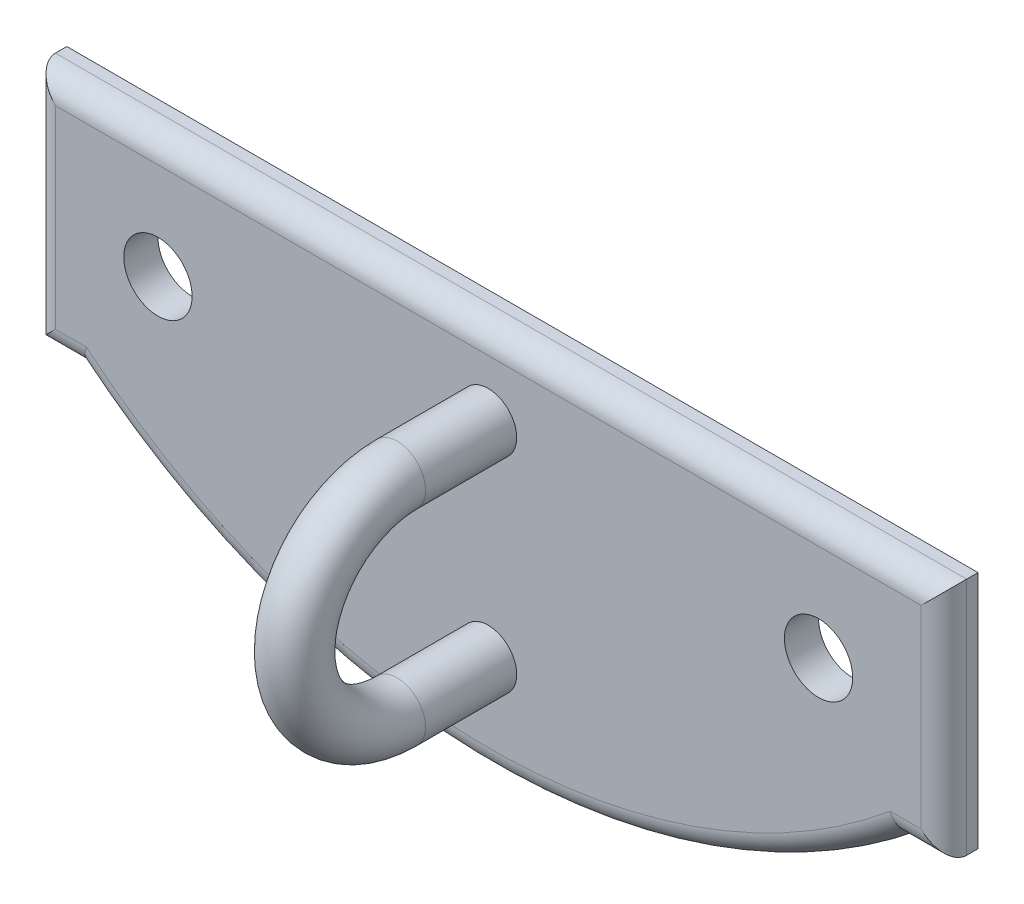
ISO-10303-21;
HEADER;
FILE_DESCRIPTION(('STEP AP214'),'2;1');
FILE_NAME('part.step','',(''),(''),'','','');
FILE_SCHEMA(('AUTOMOTIVE_DESIGN { 1 0 10303 214 1 1 1 1 }'));
ENDSEC;
DATA;
#1=APPLICATION_CONTEXT('core data for automotive mechanical design processes');
#2=APPLICATION_PROTOCOL_DEFINITION('international standard','automotive_design',2000,#1);
#3=PRODUCT_CONTEXT('',#1,'mechanical');
#4=PRODUCT('Part','Part','',(#3));
#5=PRODUCT_RELATED_PRODUCT_CATEGORY('part','',(#4));
#6=PRODUCT_DEFINITION_FORMATION('','',#4);
#7=PRODUCT_DEFINITION_CONTEXT('part definition',#1,'design');
#8=PRODUCT_DEFINITION('design','',#6,#7);
#9=PRODUCT_DEFINITION_SHAPE('','',#8);
#10=(LENGTH_UNIT() NAMED_UNIT(*) SI_UNIT(.MILLI.,.METRE.));
#11=(NAMED_UNIT(*) PLANE_ANGLE_UNIT() SI_UNIT($,.RADIAN.));
#12=(NAMED_UNIT(*) SI_UNIT($,.STERADIAN.) SOLID_ANGLE_UNIT());
#13=UNCERTAINTY_MEASURE_WITH_UNIT(LENGTH_MEASURE(1.E-05),#10,'distance_accuracy_value','');
#14=(GEOMETRIC_REPRESENTATION_CONTEXT(3) GLOBAL_UNCERTAINTY_ASSIGNED_CONTEXT((#13)) GLOBAL_UNIT_ASSIGNED_CONTEXT((#10,
#11,#12)) REPRESENTATION_CONTEXT('',''));
#15=CARTESIAN_POINT('',(0.,0.,0.));
#16=DIRECTION('',(0.,0.,1.));
#17=DIRECTION('',(1.,0.,0.));
#18=AXIS2_PLACEMENT_3D('',#15,#16,#17);
#19=CARTESIAN_POINT('',(0.,11.5705776997341,1.5));
#20=DIRECTION('',(0.,0.,-1.));
#21=DIRECTION('',(-1.,0.,0.));
#22=AXIS2_PLACEMENT_3D('',#19,#20,#21);
#23=PLANE('',#22);
#24=DIRECTION('',(0.,1.,0.));
#25=VECTOR('',#24,1.);
#26=CARTESIAN_POINT('',(19.,11.5705776997341,1.5));
#27=LINE('',#26,#25);
#28=CARTESIAN_POINT('',(19.,-9.5,1.5));
#29=VERTEX_POINT('',#28);
#30=CARTESIAN_POINT('',(19.,-1.,1.5));
#31=VERTEX_POINT('',#30);
#32=EDGE_CURVE('E178',#29,#31,#27,.T.);
#33=ORIENTED_EDGE('',*,*,#32,.T.);
#34=DIRECTION('',(-1.,0.,0.));
#35=VECTOR('',#34,1.);
#36=CARTESIAN_POINT('',(0.,-1.,1.5));
#37=LINE('',#36,#35);
#38=CARTESIAN_POINT('',(-19.,-1.,1.5));
#39=VERTEX_POINT('',#38);
#40=EDGE_CURVE('E180',#31,#39,#37,.T.);
#41=ORIENTED_EDGE('',*,*,#40,.T.);
#42=DIRECTION('',(0.,-1.,0.));
#43=VECTOR('',#42,1.);
#44=CARTESIAN_POINT('',(-19.,11.5705776997341,1.5));
#45=LINE('',#44,#43);
#46=CARTESIAN_POINT('',(-19.,-9.5,1.5));
#47=VERTEX_POINT('',#46);
#48=EDGE_CURVE('E170',#39,#47,#45,.T.);
#49=ORIENTED_EDGE('',*,*,#48,.T.);
#50=DIRECTION('',(1.,0.,0.));
#51=VECTOR('',#50,1.);
#52=CARTESIAN_POINT('',(0.,-9.5,1.5));
#53=LINE('',#52,#51);
#54=CARTESIAN_POINT('',(-17.6403275309578,-9.5,1.5));
#55=VERTEX_POINT('',#54);
#56=EDGE_CURVE('E172',#47,#55,#53,.T.);
#57=ORIENTED_EDGE('',*,*,#56,.T.);
#58=CARTESIAN_POINT('',(0.,11.5705776997341,1.5));
#59=DIRECTION('',(0.,0.,-1.));
#60=DIRECTION('',(-1.,0.,0.));
#61=AXIS2_PLACEMENT_3D('',#58,#59,#60);
#62=CIRCLE('',#61,27.48);
#63=CARTESIAN_POINT('',(17.6403275309578,-9.5,1.5));
#64=VERTEX_POINT('',#63);
#65=EDGE_CURVE('E174',#55,#64,#62,.F.);
#66=ORIENTED_EDGE('',*,*,#65,.T.);
#67=DIRECTION('',(1.,0.,0.));
#68=VECTOR('',#67,1.);
#69=CARTESIAN_POINT('',(0.,-9.49999999999998,1.5));
#70=LINE('',#69,#68);
#71=EDGE_CURVE('E176',#64,#29,#70,.T.);
#72=ORIENTED_EDGE('',*,*,#71,.T.);
#73=EDGE_LOOP('',(#33,#41,#49,#57,#66,#72));
#74=FACE_BOUND('',#73,.T.);
#75=CARTESIAN_POINT('',(14.5,-5.25,1.5));
#76=DIRECTION('',(0.,0.,1.));
#77=DIRECTION('',(-1.,0.,0.));
#78=AXIS2_PLACEMENT_3D('',#75,#76,#77);
#79=CIRCLE('',#78,1.5);
#80=CARTESIAN_POINT('',(13.,-5.25,1.5));
#81=VERTEX_POINT('',#80);
#82=EDGE_CURVE('E292',#81,#81,#79,.T.);
#83=ORIENTED_EDGE('',*,*,#82,.F.);
#84=EDGE_LOOP('',(#83));
#85=FACE_BOUND('',#84,.T.);
#86=CARTESIAN_POINT('',(-14.5,-5.25,1.5));
#87=DIRECTION('',(0.,0.,1.));
#88=DIRECTION('',(1.,0.,0.));
#89=AXIS2_PLACEMENT_3D('',#86,#87,#88);
#90=CIRCLE('',#89,1.5);
#91=CARTESIAN_POINT('',(-13.,-5.25,1.5));
#92=VERTEX_POINT('',#91);
#93=EDGE_CURVE('E150',#92,#92,#90,.T.);
#94=ORIENTED_EDGE('',*,*,#93,.F.);
#95=EDGE_LOOP('',(#94));
#96=FACE_BOUND('',#95,.T.);
#97=CARTESIAN_POINT('',(0.,-12.5,1.5));
#98=DIRECTION('',(0.,0.,1.));
#99=DIRECTION('',(1.,0.,0.));
#100=AXIS2_PLACEMENT_3D('',#97,#98,#99);
#101=CIRCLE('',#100,1.25);
#102=CARTESIAN_POINT('',(1.25,-12.5,1.5));
#103=VERTEX_POINT('',#102);
#104=EDGE_CURVE('E128',#103,#103,#101,.T.);
#105=ORIENTED_EDGE('',*,*,#104,.F.);
#106=EDGE_LOOP('',(#105));
#107=FACE_BOUND('',#106,.T.);
#108=CARTESIAN_POINT('',(0.,-3.5,1.5));
#109=DIRECTION('',(0.,0.,-1.));
#110=DIRECTION('',(1.,0.,0.));
#111=AXIS2_PLACEMENT_3D('',#108,#109,#110);
#112=CIRCLE('',#111,1.25);
#113=CARTESIAN_POINT('',(1.25,-3.5,1.5));
#114=VERTEX_POINT('',#113);
#115=EDGE_CURVE('E285',#114,#114,#112,.T.);
#116=ORIENTED_EDGE('',*,*,#115,.T.);
#117=EDGE_LOOP('',(#116));
#118=FACE_BOUND('',#117,.T.);
#119=ADVANCED_FACE('F40',(#74,#85,#96,#107,#118),#23,.F.);
#120=CARTESIAN_POINT('',(-20.,0.,1.5));
#121=DIRECTION('',(1.,0.,0.));
#122=DIRECTION('',(0.,1.,0.));
#123=AXIS2_PLACEMENT_3D('',#120,#121,#122);
#124=PLANE('',#123);
#125=DIRECTION('',(0.,0.,-1.));
#126=VECTOR('',#125,1.);
#127=CARTESIAN_POINT('',(-20.,-10.5,1.5));
#128=LINE('',#127,#126);
#129=CARTESIAN_POINT('',(-20.,-10.5,0.5));
#130=VERTEX_POINT('',#129);
#131=CARTESIAN_POINT('',(-20.,-10.5,0.));
#132=VERTEX_POINT('',#131);
#133=EDGE_CURVE('E129',#130,#132,#128,.T.);
#134=ORIENTED_EDGE('',*,*,#133,.F.);
#135=DIRECTION('',(0.,-1.,0.));
#136=VECTOR('',#135,1.);
#137=CARTESIAN_POINT('',(-20.,0.,0.5));
#138=LINE('',#137,#136);
#139=CARTESIAN_POINT('',(-20.,0.,0.5));
#140=VERTEX_POINT('',#139);
#141=EDGE_CURVE('E11',#130,#140,#138,.F.);
#142=ORIENTED_EDGE('',*,*,#141,.T.);
#143=DIRECTION('',(0.,0.,-1.));
#144=VECTOR('',#143,1.);
#145=CARTESIAN_POINT('',(-20.,0.,1.5));
#146=LINE('',#145,#144);
#147=CARTESIAN_POINT('',(-20.,0.,0.));
#148=VERTEX_POINT('',#147);
#149=EDGE_CURVE('E118',#140,#148,#146,.T.);
#150=ORIENTED_EDGE('',*,*,#149,.T.);
#151=DIRECTION('',(0.,-1.,0.));
#152=VECTOR('',#151,1.);
#153=CARTESIAN_POINT('',(-20.,0.,0.));
#154=LINE('',#153,#152);
#155=EDGE_CURVE('E122',#148,#132,#154,.T.);
#156=ORIENTED_EDGE('',*,*,#155,.T.);
#157=EDGE_LOOP('',(#134,#142,#150,#156));
#158=FACE_BOUND('',#157,.T.);
#159=ADVANCED_FACE('F120',(#158),#124,.F.);
#160=CARTESIAN_POINT('',(-20.,-10.5,1.5));
#161=DIRECTION('',(0.,1.,0.));
#162=DIRECTION('',(0.,0.,1.));
#163=AXIS2_PLACEMENT_3D('',#160,#161,#162);
#164=PLANE('',#163);
#165=DIRECTION('',(0.,0.,-1.));
#166=VECTOR('',#165,1.);
#167=CARTESIAN_POINT('',(-18.,-10.5,1.5));
#168=LINE('',#167,#166);
#169=CARTESIAN_POINT('',(-18.,-10.5,0.5));
#170=VERTEX_POINT('',#169);
#171=CARTESIAN_POINT('',(-18.,-10.5,0.));
#172=VERTEX_POINT('',#171);
#173=EDGE_CURVE('E167',#170,#172,#168,.T.);
#174=ORIENTED_EDGE('',*,*,#173,.F.);
#175=DIRECTION('',(1.,0.,0.));
#176=VECTOR('',#175,1.);
#177=CARTESIAN_POINT('',(-20.,-10.5,0.5));
#178=LINE('',#177,#176);
#179=EDGE_CURVE('E55',#170,#130,#178,.F.);
#180=ORIENTED_EDGE('',*,*,#179,.T.);
#181=ORIENTED_EDGE('',*,*,#133,.T.);
#182=DIRECTION('',(1.,0.,0.));
#183=VECTOR('',#182,1.);
#184=CARTESIAN_POINT('',(-20.,-10.5,0.));
#185=LINE('',#184,#183);
#186=EDGE_CURVE('E144',#132,#172,#185,.T.);
#187=ORIENTED_EDGE('',*,*,#186,.T.);
#188=EDGE_LOOP('',(#174,#180,#181,#187));
#189=FACE_BOUND('',#188,.T.);
#190=ADVANCED_FACE('F227',(#189),#164,.F.);
#191=CARTESIAN_POINT('',(0.,11.5705776997341,1.5));
#192=DIRECTION('',(0.,0.,-1.));
#193=DIRECTION('',(-1.,0.,0.));
#194=AXIS2_PLACEMENT_3D('',#191,#192,#193);
#195=CYLINDRICAL_SURFACE('',#194,28.48);
#196=DIRECTION('',(0.,0.,-1.));
#197=VECTOR('',#196,1.);
#198=CARTESIAN_POINT('',(18.,-10.5,1.5));
#199=LINE('',#198,#197);
#200=CARTESIAN_POINT('',(18.,-10.5,0.5));
#201=VERTEX_POINT('',#200);
#202=CARTESIAN_POINT('',(18.,-10.5,0.));
#203=VERTEX_POINT('',#202);
#204=EDGE_CURVE('E165',#201,#203,#199,.T.);
#205=ORIENTED_EDGE('',*,*,#204,.F.);
#206=CARTESIAN_POINT('',(0.,11.5705776997341,0.5));
#207=DIRECTION('',(0.,0.,-1.));
#208=DIRECTION('',(-1.,0.,0.));
#209=AXIS2_PLACEMENT_3D('',#206,#207,#208);
#210=CIRCLE('',#209,28.48);
#211=EDGE_CURVE('E70',#201,#170,#210,.T.);
#212=ORIENTED_EDGE('',*,*,#211,.T.);
#213=ORIENTED_EDGE('',*,*,#173,.T.);
#214=CARTESIAN_POINT('',(0.,11.5705776997341,0.));
#215=DIRECTION('',(0.,0.,1.));
#216=DIRECTION('',(-1.,0.,0.));
#217=AXIS2_PLACEMENT_3D('',#214,#215,#216);
#218=CIRCLE('',#217,28.48);
#219=EDGE_CURVE('E147',#172,#203,#218,.T.);
#220=ORIENTED_EDGE('',*,*,#219,.T.);
#221=EDGE_LOOP('',(#205,#212,#213,#220));
#222=FACE_BOUND('',#221,.T.);
#223=ADVANCED_FACE('F246',(#222),#195,.T.);
#224=CARTESIAN_POINT('',(20.,-10.5,1.5));
#225=DIRECTION('',(0.,1.,0.));
#226=DIRECTION('',(-1.,0.,0.));
#227=AXIS2_PLACEMENT_3D('',#224,#225,#226);
#228=PLANE('',#227);
#229=DIRECTION('',(0.,0.,-1.));
#230=VECTOR('',#229,1.);
#231=CARTESIAN_POINT('',(20.,-10.5,1.5));
#232=LINE('',#231,#230);
#233=CARTESIAN_POINT('',(20.,-10.5,0.5));
#234=VERTEX_POINT('',#233);
#235=CARTESIAN_POINT('',(20.,-10.5,0.));
#236=VERTEX_POINT('',#235);
#237=EDGE_CURVE('E163',#234,#236,#232,.T.);
#238=ORIENTED_EDGE('',*,*,#237,.F.);
#239=DIRECTION('',(1.,0.,0.));
#240=VECTOR('',#239,1.);
#241=CARTESIAN_POINT('',(20.,-10.5,0.5));
#242=LINE('',#241,#240);
#243=EDGE_CURVE('E187',#234,#201,#242,.F.);
#244=ORIENTED_EDGE('',*,*,#243,.T.);
#245=ORIENTED_EDGE('',*,*,#204,.T.);
#246=DIRECTION('',(1.,0.,0.));
#247=VECTOR('',#246,1.);
#248=CARTESIAN_POINT('',(20.,-10.5,0.));
#249=LINE('',#248,#247);
#250=EDGE_CURVE('E158',#203,#236,#249,.T.);
#251=ORIENTED_EDGE('',*,*,#250,.T.);
#252=EDGE_LOOP('',(#238,#244,#245,#251));
#253=FACE_BOUND('',#252,.T.);
#254=ADVANCED_FACE('F242',(#253),#228,.F.);
#255=CARTESIAN_POINT('',(20.,0.,1.5));
#256=DIRECTION('',(-1.,0.,0.));
#257=DIRECTION('',(0.,0.,1.));
#258=AXIS2_PLACEMENT_3D('',#255,#256,#257);
#259=PLANE('',#258);
#260=DIRECTION('',(0.,0.,-1.));
#261=VECTOR('',#260,1.);
#262=CARTESIAN_POINT('',(20.,0.,1.5));
#263=LINE('',#262,#261);
#264=CARTESIAN_POINT('',(20.,0.,0.5));
#265=VERTEX_POINT('',#264);
#266=CARTESIAN_POINT('',(20.,0.,0.));
#267=VERTEX_POINT('',#266);
#268=EDGE_CURVE('E135',#265,#267,#263,.T.);
#269=ORIENTED_EDGE('',*,*,#268,.F.);
#270=DIRECTION('',(0.,1.,0.));
#271=VECTOR('',#270,1.);
#272=CARTESIAN_POINT('',(20.,0.,0.5));
#273=LINE('',#272,#271);
#274=EDGE_CURVE('E185',#265,#234,#273,.F.);
#275=ORIENTED_EDGE('',*,*,#274,.T.);
#276=ORIENTED_EDGE('',*,*,#237,.T.);
#277=DIRECTION('',(0.,1.,0.));
#278=VECTOR('',#277,1.);
#279=CARTESIAN_POINT('',(20.,0.,0.));
#280=LINE('',#279,#278);
#281=EDGE_CURVE('E139',#236,#267,#280,.T.);
#282=ORIENTED_EDGE('',*,*,#281,.T.);
#283=EDGE_LOOP('',(#269,#275,#276,#282));
#284=FACE_BOUND('',#283,.T.);
#285=ADVANCED_FACE('F239',(#284),#259,.F.);
#286=CARTESIAN_POINT('',(0.,0.,1.5));
#287=DIRECTION('',(0.,-1.,0.));
#288=DIRECTION('',(0.,0.,-1.));
#289=AXIS2_PLACEMENT_3D('',#286,#287,#288);
#290=PLANE('',#289);
#291=ORIENTED_EDGE('',*,*,#149,.F.);
#292=DIRECTION('',(-1.,0.,0.));
#293=VECTOR('',#292,1.);
#294=CARTESIAN_POINT('',(0.,0.,0.5));
#295=LINE('',#294,#293);
#296=EDGE_CURVE('E183',#140,#265,#295,.F.);
#297=ORIENTED_EDGE('',*,*,#296,.T.);
#298=ORIENTED_EDGE('',*,*,#268,.T.);
#299=DIRECTION('',(-1.,0.,0.));
#300=VECTOR('',#299,1.);
#301=CARTESIAN_POINT('',(0.,0.,0.));
#302=LINE('',#301,#300);
#303=EDGE_CURVE('E132',#267,#148,#302,.T.);
#304=ORIENTED_EDGE('',*,*,#303,.T.);
#305=EDGE_LOOP('',(#291,#297,#298,#304));
#306=FACE_BOUND('',#305,.T.);
#307=ADVANCED_FACE('F133',(#306),#290,.F.);
#308=CARTESIAN_POINT('',(0.,11.5705776997341,0.));
#309=DIRECTION('',(0.,0.,-1.));
#310=DIRECTION('',(-1.,0.,0.));
#311=AXIS2_PLACEMENT_3D('',#308,#309,#310);
#312=PLANE('',#311);
#313=CARTESIAN_POINT('',(-14.5,-5.25,0.));
#314=DIRECTION('',(0.,0.,1.));
#315=DIRECTION('',(1.,0.,0.));
#316=AXIS2_PLACEMENT_3D('',#313,#314,#315);
#317=CIRCLE('',#316,1.5);
#318=CARTESIAN_POINT('',(-13.,-5.25,0.));
#319=VERTEX_POINT('',#318);
#320=EDGE_CURVE('E145',#319,#319,#317,.T.);
#321=ORIENTED_EDGE('',*,*,#320,.T.);
#322=EDGE_LOOP('',(#321));
#323=FACE_BOUND('',#322,.T.);
#324=CARTESIAN_POINT('',(14.5,-5.25,0.));
#325=DIRECTION('',(0.,0.,1.));
#326=DIRECTION('',(-1.,0.,0.));
#327=AXIS2_PLACEMENT_3D('',#324,#325,#326);
#328=CIRCLE('',#327,1.5);
#329=CARTESIAN_POINT('',(13.,-5.25,0.));
#330=VERTEX_POINT('',#329);
#331=EDGE_CURVE('E153',#330,#330,#328,.T.);
#332=ORIENTED_EDGE('',*,*,#331,.T.);
#333=EDGE_LOOP('',(#332));
#334=FACE_BOUND('',#333,.T.);
#335=ORIENTED_EDGE('',*,*,#155,.F.);
#336=ORIENTED_EDGE('',*,*,#303,.F.);
#337=ORIENTED_EDGE('',*,*,#281,.F.);
#338=ORIENTED_EDGE('',*,*,#250,.F.);
#339=ORIENTED_EDGE('',*,*,#219,.F.);
#340=ORIENTED_EDGE('',*,*,#186,.F.);
#341=EDGE_LOOP('',(#335,#336,#337,#338,#339,#340));
#342=FACE_BOUND('',#341,.T.);
#343=ADVANCED_FACE('F141',(#323,#334,#342),#312,.T.);
#344=CARTESIAN_POINT('',(14.5,-5.25,0.));
#345=DIRECTION('',(0.,0.,1.));
#346=DIRECTION('',(1.,0.,0.));
#347=AXIS2_PLACEMENT_3D('',#344,#345,#346);
#348=CYLINDRICAL_SURFACE('',#347,1.5);
#349=ORIENTED_EDGE('',*,*,#331,.F.);
#350=EDGE_LOOP('',(#349));
#351=FACE_BOUND('',#350,.T.);
#352=ORIENTED_EDGE('',*,*,#82,.T.);
#353=EDGE_LOOP('',(#352));
#354=FACE_BOUND('',#353,.T.);
#355=ADVANCED_FACE('F232',(#351,#354),#348,.F.);
#356=CARTESIAN_POINT('',(-14.5,-5.25,0.));
#357=DIRECTION('',(0.,0.,1.));
#358=DIRECTION('',(1.,0.,0.));
#359=AXIS2_PLACEMENT_3D('',#356,#357,#358);
#360=CYLINDRICAL_SURFACE('',#359,1.5);
#361=ORIENTED_EDGE('',*,*,#320,.F.);
#362=EDGE_LOOP('',(#361));
#363=FACE_BOUND('',#362,.T.);
#364=ORIENTED_EDGE('',*,*,#93,.T.);
#365=EDGE_LOOP('',(#364));
#366=FACE_BOUND('',#365,.T.);
#367=ADVANCED_FACE('F301',(#363,#366),#360,.F.);
#368=CARTESIAN_POINT('',(0.,-12.5,1.5));
#369=DIRECTION('',(0.,0.,1.));
#370=DIRECTION('',(1.,0.,0.));
#371=AXIS2_PLACEMENT_3D('',#368,#369,#370);
#372=CYLINDRICAL_SURFACE('',#371,1.25);
#373=CARTESIAN_POINT('',(0.,-12.5,5.5));
#374=DIRECTION('',(0.,0.,1.));
#375=DIRECTION('',(1.,0.,0.));
#376=AXIS2_PLACEMENT_3D('',#373,#374,#375);
#377=CIRCLE('',#376,1.25);
#378=CARTESIAN_POINT('',(0.,-13.75,5.5));
#379=VERTEX_POINT('',#378);
#380=EDGE_CURVE('E271',#379,#379,#377,.T.);
#381=ORIENTED_EDGE('',*,*,#380,.F.);
#382=EDGE_LOOP('',(#381));
#383=FACE_BOUND('',#382,.T.);
#384=ORIENTED_EDGE('',*,*,#104,.T.);
#385=EDGE_LOOP('',(#384));
#386=FACE_BOUND('',#385,.T.);
#387=ADVANCED_FACE('F305',(#383,#386),#372,.T.);
#388=CARTESIAN_POINT('',(0.,-8.,5.5));
#389=DIRECTION('',(-1.,0.,0.));
#390=DIRECTION('',(0.,0.,1.));
#391=AXIS2_PLACEMENT_3D('',#388,#389,#390);
#392=TOROIDAL_SURFACE('',#391,4.5,1.25);
#393=CARTESIAN_POINT('',(0.,-3.5,5.5));
#394=DIRECTION('',(0.,0.,-1.));
#395=DIRECTION('',(1.,0.,0.));
#396=AXIS2_PLACEMENT_3D('',#393,#394,#395);
#397=CIRCLE('',#396,1.25);
#398=CARTESIAN_POINT('',(0.,-2.25,5.5));
#399=VERTEX_POINT('',#398);
#400=EDGE_CURVE('E280',#399,#399,#397,.T.);
#401=CARTESIAN_POINT('',(0.,-8.,5.5));
#402=DIRECTION('',(-1.,0.,0.));
#403=DIRECTION('',(0.,0.,1.));
#404=AXIS2_PLACEMENT_3D('',#401,#402,#403);
#405=CIRCLE('',#404,5.75);
#406=EDGE_CURVE('',#379,#399,#405,.T.);
#407=ORIENTED_EDGE('',*,*,#380,.T.);
#408=ORIENTED_EDGE('',*,*,#400,.F.);
#409=ORIENTED_EDGE('',*,*,#406,.T.);
#410=ORIENTED_EDGE('',*,*,#406,.F.);
#411=EDGE_LOOP('',(#407,#409,#408,#410));
#412=FACE_BOUND('',#411,.T.);
#413=ADVANCED_FACE('F311',(#412),#392,.T.);
#414=CARTESIAN_POINT('',(0.,-3.5,5.5));
#415=DIRECTION('',(0.,0.,-1.));
#416=DIRECTION('',(-1.,0.,0.));
#417=AXIS2_PLACEMENT_3D('',#414,#415,#416);
#418=CYLINDRICAL_SURFACE('',#417,1.25);
#419=ORIENTED_EDGE('',*,*,#115,.F.);
#420=EDGE_LOOP('',(#419));
#421=FACE_BOUND('',#420,.T.);
#422=ORIENTED_EDGE('',*,*,#400,.T.);
#423=EDGE_LOOP('',(#422));
#424=FACE_BOUND('',#423,.T.);
#425=ADVANCED_FACE('F307',(#421,#424),#418,.T.);
#426=CARTESIAN_POINT('',(0.,11.5705776997341,0.5));
#427=DIRECTION('',(0.,0.,-1.));
#428=DIRECTION('',(-1.,0.,0.));
#429=AXIS2_PLACEMENT_3D('',#426,#427,#428);
#430=TOROIDAL_SURFACE('',#429,27.48,1.);
#431=CARTESIAN_POINT('',(-18.,-10.5,0.5));
#432=CARTESIAN_POINT('',(-18.0000001822322,-10.500000627018,0.526950831421484));
#433=CARTESIAN_POINT('',(-17.9996117815744,-10.4989097289285,0.553888316560886));
#434=CARTESIAN_POINT('',(-17.9980639617203,-10.4945631195976,0.607561372393919));
#435=CARTESIAN_POINT('',(-17.9969046687242,-10.4913077626924,0.634296975412562));
#436=CARTESIAN_POINT('',(-17.9922891752805,-10.4783490401262,0.713784456826546));
#437=CARTESIAN_POINT('',(-17.9876952698818,-10.4654527569829,0.765988656392801));
#438=CARTESIAN_POINT('',(-17.9756379601428,-10.4316259943196,0.867329755278999));
#439=CARTESIAN_POINT('',(-17.968174798452,-10.4106961941844,0.916466913566523));
#440=CARTESIAN_POINT('',(-17.9506329119642,-10.361543315154,1.01044576921566));
#441=CARTESIAN_POINT('',(-17.9405535870331,-10.3333185628412,1.0552864777585));
#442=CARTESIAN_POINT('',(-17.917829126345,-10.2697506079071,1.1406110335761));
#443=CARTESIAN_POINT('',(-17.9051283047558,-10.2342530633733,1.18096476272246));
#444=CARTESIAN_POINT('',(-17.8776991316521,-10.1576866495275,1.25517723464379));
#445=CARTESIAN_POINT('',(-17.8629701133007,-10.1166159479204,1.2890338324722));
#446=CARTESIAN_POINT('',(-17.8310322616493,-10.0276830963119,1.35126741267612));
#447=CARTESIAN_POINT('',(-17.8137315874022,-9.97957163857921,1.37924053140085));
#448=CARTESIAN_POINT('',(-17.7777957946803,-9.87979597521838,1.42671830096519));
#449=CARTESIAN_POINT('',(-17.759160523133,-9.82813136208579,1.44622197857868));
#450=CARTESIAN_POINT('',(-17.7243166442786,-9.73168976049804,1.47385288280796));
#451=CARTESIAN_POINT('',(-17.7082399218087,-9.68725098712408,1.48335746756641));
#452=CARTESIAN_POINT('',(-17.6757859241264,-9.59766796198286,1.49624380847264));
#453=CARTESIAN_POINT('',(-17.6594092940814,-9.55252524993668,1.49963743377316));
#454=CARTESIAN_POINT('',(-17.6421245615427,-9.50494606364797,1.49999084758679));
#455=CARTESIAN_POINT('',(-17.6412260478658,-9.50247294099537,1.50000002288174));
#456=CARTESIAN_POINT('',(-17.6403275309578,-9.5,1.5));
#457=B_SPLINE_CURVE_WITH_KNOTS('',3,(#431,#432,#433,#434,#435,#436,#437,#438,#439,#440,#441,
#442,#443,#444,#445,#446,#447,#448,#449,#450,#451,#452,#453,#454,#455,#456),.UNSPECIFIED.,.F.,
.F.,(4,2,2,2,2,2,2,2,2,2,2,2,4),(0.,0.0808013483129601,0.161589472173366,0.322657517703281,
0.483711944901641,0.644803349846643,0.809754145967849,0.97475930519682,1.14884097786518,
1.32294264902305,1.4671879697696,1.61115282326392,1.61904665159802),.UNSPECIFIED.);
#458=EDGE_CURVE('E200',#170,#55,#457,.T.);
#459=ORIENTED_EDGE('',*,*,#458,.F.);
#460=ORIENTED_EDGE('',*,*,#211,.F.);
#461=CARTESIAN_POINT('',(18.,-10.5,0.5));
#462=CARTESIAN_POINT('',(18.0000001822322,-10.500000627018,0.526950831421484));
#463=CARTESIAN_POINT('',(17.9996117815744,-10.4989097289285,0.553888316560886));
#464=CARTESIAN_POINT('',(17.9980639617203,-10.4945631195976,0.60756137239392));
#465=CARTESIAN_POINT('',(17.9969046687242,-10.4913077626924,0.634296975412563));
#466=CARTESIAN_POINT('',(17.9922891752805,-10.4783490401261,0.713784456826547));
#467=CARTESIAN_POINT('',(17.9876952698818,-10.4654527569829,0.765988656392802));
#468=CARTESIAN_POINT('',(17.9756379601428,-10.4316259943196,0.867329755279));
#469=CARTESIAN_POINT('',(17.968174798452,-10.4106961941844,0.916466913566524));
#470=CARTESIAN_POINT('',(17.9506329119642,-10.361543315154,1.01044576921566));
#471=CARTESIAN_POINT('',(17.9405535870331,-10.3333185628412,1.0552864777585));
#472=CARTESIAN_POINT('',(17.917829126345,-10.2697506079071,1.1406110335761));
#473=CARTESIAN_POINT('',(17.9051283047558,-10.2342530633733,1.18096476272246));
#474=CARTESIAN_POINT('',(17.8776991316521,-10.1576866495274,1.2551772346438));
#475=CARTESIAN_POINT('',(17.8629701133007,-10.1166159479204,1.2890338324722));
#476=CARTESIAN_POINT('',(17.8310322616493,-10.0276830963119,1.35126741267612));
#477=CARTESIAN_POINT('',(17.8137315874022,-9.97957163857921,1.37924053140085));
#478=CARTESIAN_POINT('',(17.7777957946803,-9.87979597521837,1.4267183009652));
#479=CARTESIAN_POINT('',(17.759160523133,-9.82813136208579,1.44622197857868));
#480=CARTESIAN_POINT('',(17.7243166442786,-9.73168976049804,1.47385288280796));
#481=CARTESIAN_POINT('',(17.7082399218088,-9.68725098712406,1.48335746756641));
#482=CARTESIAN_POINT('',(17.6757859241263,-9.59766796198288,1.49624380847264));
#483=CARTESIAN_POINT('',(17.6594092940812,-9.55252524993675,1.49963743377316));
#484=CARTESIAN_POINT('',(17.6421245615427,-9.50494606364797,1.49999084758679));
#485=CARTESIAN_POINT('',(17.6412260478658,-9.50247294099537,1.50000002288174));
#486=CARTESIAN_POINT('',(17.6403275309578,-9.5,1.5));
#487=B_SPLINE_CURVE_WITH_KNOTS('',3,(#461,#462,#463,#464,#465,#466,#467,#468,#469,#470,#471,
#472,#473,#474,#475,#476,#477,#478,#479,#480,#481,#482,#483,#484,#485,#486),.UNSPECIFIED.,.F.,
.F.,(4,2,2,2,2,2,2,2,2,2,2,2,4),(0.,0.0808013483129604,0.161589472173366,0.322657517703282,
0.483711944901643,0.644803349846644,0.80975414596785,0.97475930519682,1.14884097786518,
1.32294264902305,1.46718796976959,1.61115282326391,1.61904665159802),.UNSPECIFIED.);
#488=EDGE_CURVE('E45',#64,#201,#487,.F.);
#489=ORIENTED_EDGE('',*,*,#488,.F.);
#490=ORIENTED_EDGE('',*,*,#65,.F.);
#491=EDGE_LOOP('',(#459,#460,#489,#490));
#492=FACE_BOUND('',#491,.T.);
#493=ADVANCED_FACE('F206',(#492),#430,.T.);
#494=CARTESIAN_POINT('',(0.,-9.49999999999998,0.5));
#495=DIRECTION('',(1.,0.,0.));
#496=DIRECTION('',(0.,1.,0.));
#497=AXIS2_PLACEMENT_3D('',#494,#495,#496);
#498=CYLINDRICAL_SURFACE('',#497,1.);
#499=ORIENTED_EDGE('',*,*,#488,.T.);
#500=ORIENTED_EDGE('',*,*,#243,.F.);
#501=CARTESIAN_POINT('',(19.,-9.5,0.5));
#502=DIRECTION('',(0.707106781186548,0.707106781186547,0.));
#503=DIRECTION('',(0.707106781186547,-0.707106781186548,0.));
#504=AXIS2_PLACEMENT_3D('',#501,#502,#503);
#505=ELLIPSE('',#504,1.4142135623731,1.);
#506=EDGE_CURVE('E198',#29,#234,#505,.T.);
#507=ORIENTED_EDGE('',*,*,#506,.F.);
#508=ORIENTED_EDGE('',*,*,#71,.F.);
#509=EDGE_LOOP('',(#499,#500,#507,#508));
#510=FACE_BOUND('',#509,.T.);
#511=ADVANCED_FACE('F42',(#510),#498,.T.);
#512=CARTESIAN_POINT('',(0.,-9.5,0.5));
#513=DIRECTION('',(1.,0.,0.));
#514=DIRECTION('',(0.,0.,-1.));
#515=AXIS2_PLACEMENT_3D('',#512,#513,#514);
#516=CYLINDRICAL_SURFACE('',#515,1.);
#517=ORIENTED_EDGE('',*,*,#458,.T.);
#518=ORIENTED_EDGE('',*,*,#56,.F.);
#519=CARTESIAN_POINT('',(-19.,-9.5,0.5));
#520=DIRECTION('',(0.707106781186547,-0.707106781186548,0.));
#521=DIRECTION('',(-0.707106781186548,-0.707106781186547,0.));
#522=AXIS2_PLACEMENT_3D('',#519,#520,#521);
#523=ELLIPSE('',#522,1.4142135623731,1.);
#524=EDGE_CURVE('E195',#130,#47,#523,.F.);
#525=ORIENTED_EDGE('',*,*,#524,.F.);
#526=ORIENTED_EDGE('',*,*,#179,.F.);
#527=EDGE_LOOP('',(#517,#518,#525,#526));
#528=FACE_BOUND('',#527,.T.);
#529=ADVANCED_FACE('F209',(#528),#516,.T.);
#530=CARTESIAN_POINT('',(19.,11.5705776997341,0.5));
#531=DIRECTION('',(0.,1.,0.));
#532=DIRECTION('',(0.,0.,1.));
#533=AXIS2_PLACEMENT_3D('',#530,#531,#532);
#534=CYLINDRICAL_SURFACE('',#533,1.);
#535=ORIENTED_EDGE('',*,*,#506,.T.);
#536=ORIENTED_EDGE('',*,*,#274,.F.);
#537=CARTESIAN_POINT('',(19.,-1.,0.5));
#538=DIRECTION('',(-0.707106781186547,0.707106781186547,0.));
#539=DIRECTION('',(0.707106781186547,0.707106781186547,0.));
#540=AXIS2_PLACEMENT_3D('',#537,#538,#539);
#541=ELLIPSE('',#540,1.41421356237309,1.);
#542=EDGE_CURVE('E193',#31,#265,#541,.T.);
#543=ORIENTED_EDGE('',*,*,#542,.F.);
#544=ORIENTED_EDGE('',*,*,#32,.F.);
#545=EDGE_LOOP('',(#535,#536,#543,#544));
#546=FACE_BOUND('',#545,.T.);
#547=ADVANCED_FACE('F212',(#546),#534,.T.);
#548=CARTESIAN_POINT('',(-19.,11.5705776997341,0.5));
#549=DIRECTION('',(0.,-1.,0.));
#550=DIRECTION('',(1.,0.,0.));
#551=AXIS2_PLACEMENT_3D('',#548,#549,#550);
#552=CYLINDRICAL_SURFACE('',#551,1.);
#553=ORIENTED_EDGE('',*,*,#524,.T.);
#554=ORIENTED_EDGE('',*,*,#48,.F.);
#555=CARTESIAN_POINT('',(-19.,-1.,0.5));
#556=DIRECTION('',(-0.707106781186548,-0.707106781186547,0.));
#557=DIRECTION('',(0.707106781186547,-0.707106781186548,0.));
#558=AXIS2_PLACEMENT_3D('',#555,#556,#557);
#559=ELLIPSE('',#558,1.41421356237309,1.);
#560=EDGE_CURVE('E191',#140,#39,#559,.F.);
#561=ORIENTED_EDGE('',*,*,#560,.F.);
#562=ORIENTED_EDGE('',*,*,#141,.F.);
#563=EDGE_LOOP('',(#553,#554,#561,#562));
#564=FACE_BOUND('',#563,.T.);
#565=ADVANCED_FACE('F218',(#564),#552,.T.);
#566=CARTESIAN_POINT('',(0.,-1.,0.5));
#567=DIRECTION('',(-1.,0.,0.));
#568=DIRECTION('',(0.,0.,1.));
#569=AXIS2_PLACEMENT_3D('',#566,#567,#568);
#570=CYLINDRICAL_SURFACE('',#569,1.);
#571=ORIENTED_EDGE('',*,*,#542,.T.);
#572=ORIENTED_EDGE('',*,*,#296,.F.);
#573=ORIENTED_EDGE('',*,*,#560,.T.);
#574=ORIENTED_EDGE('',*,*,#40,.F.);
#575=EDGE_LOOP('',(#571,#572,#573,#574));
#576=FACE_BOUND('',#575,.T.);
#577=ADVANCED_FACE('F252',(#576),#570,.T.);
#578=CLOSED_SHELL('',(#119,#159,#190,#223,#254,#285,#307,#343,#355,#367,#387,#413,#425,#493,
#511,#529,#547,#565,#577));
#579=MANIFOLD_SOLID_BREP('B2',#578);
#580=ADVANCED_BREP_SHAPE_REPRESENTATION('',(#18,#579),#14);
#581=SHAPE_DEFINITION_REPRESENTATION(#9,#580);
ENDSEC;
END-ISO-10303-21;
